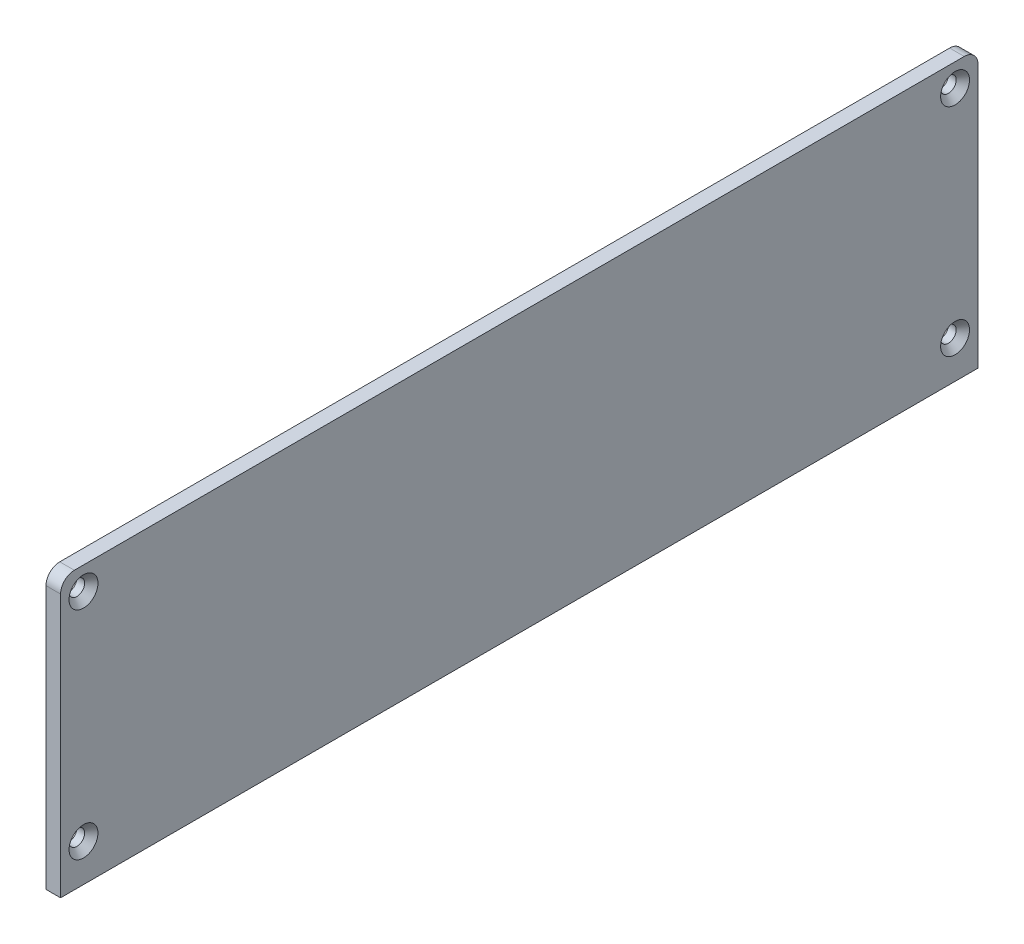
ISO-10303-21;
HEADER;
FILE_DESCRIPTION(('STEP AP214'),'2;1');
FILE_NAME('part.step','',(''),(''),'','','');
FILE_SCHEMA(('AUTOMOTIVE_DESIGN { 1 0 10303 214 1 1 1 1 }'));
ENDSEC;
DATA;
#1=APPLICATION_CONTEXT('core data for automotive mechanical design processes');
#2=APPLICATION_PROTOCOL_DEFINITION('international standard','automotive_design',2000,#1);
#3=PRODUCT_CONTEXT('',#1,'mechanical');
#4=PRODUCT('Part','Part','',(#3));
#5=PRODUCT_RELATED_PRODUCT_CATEGORY('part','',(#4));
#6=PRODUCT_DEFINITION_FORMATION('','',#4);
#7=PRODUCT_DEFINITION_CONTEXT('part definition',#1,'design');
#8=PRODUCT_DEFINITION('design','',#6,#7);
#9=PRODUCT_DEFINITION_SHAPE('','',#8);
#10=(LENGTH_UNIT() NAMED_UNIT(*) SI_UNIT(.MILLI.,.METRE.));
#11=(NAMED_UNIT(*) PLANE_ANGLE_UNIT() SI_UNIT($,.RADIAN.));
#12=(NAMED_UNIT(*) SI_UNIT($,.STERADIAN.) SOLID_ANGLE_UNIT());
#13=UNCERTAINTY_MEASURE_WITH_UNIT(LENGTH_MEASURE(1.E-05),#10,'distance_accuracy_value','');
#14=(GEOMETRIC_REPRESENTATION_CONTEXT(3) GLOBAL_UNCERTAINTY_ASSIGNED_CONTEXT((#13)) GLOBAL_UNIT_ASSIGNED_CONTEXT((#10,
#11,#12)) REPRESENTATION_CONTEXT('',''));
#15=CARTESIAN_POINT('',(0.,0.,0.));
#16=DIRECTION('',(0.,0.,1.));
#17=DIRECTION('',(1.,0.,0.));
#18=AXIS2_PLACEMENT_3D('',#15,#16,#17);
#19=CARTESIAN_POINT('',(3.175,0.,100.));
#20=DIRECTION('',(0.,0.,-1.));
#21=DIRECTION('',(-1.,0.,0.));
#22=AXIS2_PLACEMENT_3D('',#19,#20,#21);
#23=PLANE('',#22);
#24=DIRECTION('',(0.,-1.,0.));
#25=VECTOR('',#24,1.);
#26=CARTESIAN_POINT('',(0.,0.,100.));
#27=LINE('',#26,#25);
#28=CARTESIAN_POINT('',(0.,57.35,100.));
#29=VERTEX_POINT('',#28);
#30=CARTESIAN_POINT('',(0.,0.,100.));
#31=VERTEX_POINT('',#30);
#32=EDGE_CURVE('E116',#29,#31,#27,.T.);
#33=ORIENTED_EDGE('',*,*,#32,.T.);
#34=DIRECTION('',(-1.,0.,0.));
#35=VECTOR('',#34,1.);
#36=CARTESIAN_POINT('',(3.175,0.,100.));
#37=LINE('',#36,#35);
#38=CARTESIAN_POINT('',(3.175,0.,100.));
#39=VERTEX_POINT('',#38);
#40=EDGE_CURVE('E11',#39,#31,#37,.T.);
#41=ORIENTED_EDGE('',*,*,#40,.F.);
#42=DIRECTION('',(0.,-1.,0.));
#43=VECTOR('',#42,1.);
#44=CARTESIAN_POINT('',(3.175,0.,100.));
#45=LINE('',#44,#43);
#46=CARTESIAN_POINT('',(3.175,57.35,100.));
#47=VERTEX_POINT('',#46);
#48=EDGE_CURVE('E127',#47,#39,#45,.T.);
#49=ORIENTED_EDGE('',*,*,#48,.F.);
#50=DIRECTION('',(-1.,0.,0.));
#51=VECTOR('',#50,1.);
#52=CARTESIAN_POINT('',(3.175,57.35,100.));
#53=LINE('',#52,#51);
#54=EDGE_CURVE('E112',#47,#29,#53,.T.);
#55=ORIENTED_EDGE('',*,*,#54,.T.);
#56=EDGE_LOOP('',(#33,#41,#49,#55));
#57=FACE_BOUND('',#56,.T.);
#58=ADVANCED_FACE('F32',(#57),#23,.F.);
#59=CARTESIAN_POINT('',(3.175,0.,100.));
#60=DIRECTION('',(0.,1.,0.));
#61=DIRECTION('',(0.,0.,1.));
#62=AXIS2_PLACEMENT_3D('',#59,#60,#61);
#63=PLANE('',#62);
#64=DIRECTION('',(0.,0.,-1.));
#65=VECTOR('',#64,1.);
#66=CARTESIAN_POINT('',(0.,0.,100.));
#67=LINE('',#66,#65);
#68=CARTESIAN_POINT('',(0.,0.,-100.));
#69=VERTEX_POINT('',#68);
#70=EDGE_CURVE('E119',#31,#69,#67,.T.);
#71=ORIENTED_EDGE('',*,*,#70,.T.);
#72=DIRECTION('',(-1.,0.,0.));
#73=VECTOR('',#72,1.);
#74=CARTESIAN_POINT('',(3.175,0.,-100.));
#75=LINE('',#74,#73);
#76=CARTESIAN_POINT('',(3.175,0.,-100.));
#77=VERTEX_POINT('',#76);
#78=EDGE_CURVE('E40',#77,#69,#75,.T.);
#79=ORIENTED_EDGE('',*,*,#78,.F.);
#80=DIRECTION('',(0.,0.,-1.));
#81=VECTOR('',#80,1.);
#82=CARTESIAN_POINT('',(3.175,0.,100.));
#83=LINE('',#82,#81);
#84=EDGE_CURVE('E85',#39,#77,#83,.T.);
#85=ORIENTED_EDGE('',*,*,#84,.F.);
#86=ORIENTED_EDGE('',*,*,#40,.T.);
#87=EDGE_LOOP('',(#71,#79,#85,#86));
#88=FACE_BOUND('',#87,.T.);
#89=ADVANCED_FACE('F152',(#88),#63,.F.);
#90=CARTESIAN_POINT('',(3.175,0.,-100.));
#91=DIRECTION('',(0.,0.,1.));
#92=DIRECTION('',(1.,0.,0.));
#93=AXIS2_PLACEMENT_3D('',#90,#91,#92);
#94=PLANE('',#93);
#95=DIRECTION('',(0.,1.,0.));
#96=VECTOR('',#95,1.);
#97=CARTESIAN_POINT('',(0.,0.,-100.));
#98=LINE('',#97,#96);
#99=CARTESIAN_POINT('',(0.,57.35,-100.));
#100=VERTEX_POINT('',#99);
#101=EDGE_CURVE('E122',#69,#100,#98,.T.);
#102=ORIENTED_EDGE('',*,*,#101,.T.);
#103=DIRECTION('',(-1.,0.,0.));
#104=VECTOR('',#103,1.);
#105=CARTESIAN_POINT('',(3.175,57.35,-100.));
#106=LINE('',#105,#104);
#107=CARTESIAN_POINT('',(3.175,57.35,-100.));
#108=VERTEX_POINT('',#107);
#109=EDGE_CURVE('E107',#108,#100,#106,.T.);
#110=ORIENTED_EDGE('',*,*,#109,.F.);
#111=DIRECTION('',(0.,1.,0.));
#112=VECTOR('',#111,1.);
#113=CARTESIAN_POINT('',(3.175,0.,-100.));
#114=LINE('',#113,#112);
#115=EDGE_CURVE('E98',#77,#108,#114,.T.);
#116=ORIENTED_EDGE('',*,*,#115,.F.);
#117=ORIENTED_EDGE('',*,*,#78,.T.);
#118=EDGE_LOOP('',(#102,#110,#116,#117));
#119=FACE_BOUND('',#118,.T.);
#120=ADVANCED_FACE('F133',(#119),#94,.F.);
#121=CARTESIAN_POINT('',(3.175,57.35,-97.));
#122=DIRECTION('',(-1.,0.,0.));
#123=DIRECTION('',(0.,0.,1.));
#124=AXIS2_PLACEMENT_3D('',#121,#122,#123);
#125=CYLINDRICAL_SURFACE('',#124,3.);
#126=CARTESIAN_POINT('',(0.,57.35,-97.));
#127=DIRECTION('',(1.,0.,0.));
#128=DIRECTION('',(0.,0.,-1.));
#129=AXIS2_PLACEMENT_3D('',#126,#127,#128);
#130=CIRCLE('',#129,3.);
#131=CARTESIAN_POINT('',(0.,60.35,-97.));
#132=VERTEX_POINT('',#131);
#133=EDGE_CURVE('E106',#100,#132,#130,.T.);
#134=ORIENTED_EDGE('',*,*,#133,.T.);
#135=DIRECTION('',(-1.,0.,0.));
#136=VECTOR('',#135,1.);
#137=CARTESIAN_POINT('',(3.175,60.35,-97.));
#138=LINE('',#137,#136);
#139=CARTESIAN_POINT('',(3.175,60.35,-97.));
#140=VERTEX_POINT('',#139);
#141=EDGE_CURVE('E103',#140,#132,#138,.T.);
#142=ORIENTED_EDGE('',*,*,#141,.F.);
#143=CARTESIAN_POINT('',(3.175,57.35,-97.));
#144=DIRECTION('',(1.,0.,0.));
#145=DIRECTION('',(0.,0.,-1.));
#146=AXIS2_PLACEMENT_3D('',#143,#144,#145);
#147=CIRCLE('',#146,3.);
#148=EDGE_CURVE('E92',#108,#140,#147,.T.);
#149=ORIENTED_EDGE('',*,*,#148,.F.);
#150=ORIENTED_EDGE('',*,*,#109,.T.);
#151=EDGE_LOOP('',(#134,#142,#149,#150));
#152=FACE_BOUND('',#151,.T.);
#153=ADVANCED_FACE('F104',(#152),#125,.T.);
#154=CARTESIAN_POINT('',(3.175,60.35,-97.));
#155=DIRECTION('',(0.,-1.,0.));
#156=DIRECTION('',(0.,0.,-1.));
#157=AXIS2_PLACEMENT_3D('',#154,#155,#156);
#158=PLANE('',#157);
#159=DIRECTION('',(0.,0.,1.));
#160=VECTOR('',#159,1.);
#161=CARTESIAN_POINT('',(0.,60.35,-97.));
#162=LINE('',#161,#160);
#163=CARTESIAN_POINT('',(0.,60.35,97.));
#164=VERTEX_POINT('',#163);
#165=EDGE_CURVE('E71',#132,#164,#162,.T.);
#166=ORIENTED_EDGE('',*,*,#165,.T.);
#167=DIRECTION('',(-1.,0.,0.));
#168=VECTOR('',#167,1.);
#169=CARTESIAN_POINT('',(3.175,60.35,97.));
#170=LINE('',#169,#168);
#171=CARTESIAN_POINT('',(3.175,60.35,97.));
#172=VERTEX_POINT('',#171);
#173=EDGE_CURVE('E108',#172,#164,#170,.T.);
#174=ORIENTED_EDGE('',*,*,#173,.F.);
#175=DIRECTION('',(0.,0.,1.));
#176=VECTOR('',#175,1.);
#177=CARTESIAN_POINT('',(3.175,60.35,-97.));
#178=LINE('',#177,#176);
#179=EDGE_CURVE('E96',#140,#172,#178,.T.);
#180=ORIENTED_EDGE('',*,*,#179,.F.);
#181=ORIENTED_EDGE('',*,*,#141,.T.);
#182=EDGE_LOOP('',(#166,#174,#180,#181));
#183=FACE_BOUND('',#182,.T.);
#184=ADVANCED_FACE('F110',(#183),#158,.F.);
#185=CARTESIAN_POINT('',(3.175,57.35,97.));
#186=DIRECTION('',(-1.,0.,0.));
#187=DIRECTION('',(0.,0.,1.));
#188=AXIS2_PLACEMENT_3D('',#185,#186,#187);
#189=CYLINDRICAL_SURFACE('',#188,3.);
#190=CARTESIAN_POINT('',(0.,57.35,97.));
#191=DIRECTION('',(1.,0.,0.));
#192=DIRECTION('',(0.,0.,-1.));
#193=AXIS2_PLACEMENT_3D('',#190,#191,#192);
#194=CIRCLE('',#193,3.);
#195=EDGE_CURVE('E77',#164,#29,#194,.T.);
#196=ORIENTED_EDGE('',*,*,#195,.T.);
#197=ORIENTED_EDGE('',*,*,#54,.F.);
#198=CARTESIAN_POINT('',(3.175,57.35,97.));
#199=DIRECTION('',(1.,0.,0.));
#200=DIRECTION('',(0.,0.,-1.));
#201=AXIS2_PLACEMENT_3D('',#198,#199,#200);
#202=CIRCLE('',#201,3.);
#203=EDGE_CURVE('E48',#172,#47,#202,.T.);
#204=ORIENTED_EDGE('',*,*,#203,.F.);
#205=ORIENTED_EDGE('',*,*,#173,.T.);
#206=EDGE_LOOP('',(#196,#197,#204,#205));
#207=FACE_BOUND('',#206,.T.);
#208=ADVANCED_FACE('F140',(#207),#189,.T.);
#209=CARTESIAN_POINT('',(3.175,57.35,97.));
#210=DIRECTION('',(1.,0.,0.));
#211=DIRECTION('',(0.,0.,-1.));
#212=AXIS2_PLACEMENT_3D('',#209,#210,#211);
#213=PLANE('',#212);
#214=CARTESIAN_POINT('',(3.175,8.175,-95.));
#215=DIRECTION('',(1.,0.,0.));
#216=DIRECTION('',(0.,0.,-1.));
#217=AXIS2_PLACEMENT_3D('',#214,#215,#216);
#218=CIRCLE('',#217,3.15);
#219=CARTESIAN_POINT('',(3.175,8.175,-98.15));
#220=VERTEX_POINT('',#219);
#221=EDGE_CURVE('E278',#220,#220,#218,.T.);
#222=ORIENTED_EDGE('',*,*,#221,.F.);
#223=EDGE_LOOP('',(#222));
#224=FACE_BOUND('',#223,.T.);
#225=CARTESIAN_POINT('',(3.175,55.35,-95.));
#226=DIRECTION('',(1.,0.,0.));
#227=DIRECTION('',(0.,0.,-1.));
#228=AXIS2_PLACEMENT_3D('',#225,#226,#227);
#229=CIRCLE('',#228,3.15);
#230=CARTESIAN_POINT('',(3.175,55.35,-98.15));
#231=VERTEX_POINT('',#230);
#232=EDGE_CURVE('E285',#231,#231,#229,.T.);
#233=ORIENTED_EDGE('',*,*,#232,.F.);
#234=EDGE_LOOP('',(#233));
#235=FACE_BOUND('',#234,.T.);
#236=CARTESIAN_POINT('',(3.175,8.175,95.));
#237=DIRECTION('',(1.,0.,0.));
#238=DIRECTION('',(0.,0.,-1.));
#239=AXIS2_PLACEMENT_3D('',#236,#237,#238);
#240=CIRCLE('',#239,3.15);
#241=CARTESIAN_POINT('',(3.175,8.175,91.85));
#242=VERTEX_POINT('',#241);
#243=EDGE_CURVE('E294',#242,#242,#240,.T.);
#244=ORIENTED_EDGE('',*,*,#243,.F.);
#245=EDGE_LOOP('',(#244));
#246=FACE_BOUND('',#245,.T.);
#247=CARTESIAN_POINT('',(3.175,55.35,95.));
#248=DIRECTION('',(1.,0.,0.));
#249=DIRECTION('',(0.,0.,-1.));
#250=AXIS2_PLACEMENT_3D('',#247,#248,#249);
#251=CIRCLE('',#250,3.15);
#252=CARTESIAN_POINT('',(3.175,55.35,91.85));
#253=VERTEX_POINT('',#252);
#254=EDGE_CURVE('E303',#253,#253,#251,.T.);
#255=ORIENTED_EDGE('',*,*,#254,.F.);
#256=EDGE_LOOP('',(#255));
#257=FACE_BOUND('',#256,.T.);
#258=ORIENTED_EDGE('',*,*,#48,.T.);
#259=ORIENTED_EDGE('',*,*,#84,.T.);
#260=ORIENTED_EDGE('',*,*,#115,.T.);
#261=ORIENTED_EDGE('',*,*,#148,.T.);
#262=ORIENTED_EDGE('',*,*,#179,.T.);
#263=ORIENTED_EDGE('',*,*,#203,.T.);
#264=EDGE_LOOP('',(#258,#259,#260,#261,#262,#263));
#265=FACE_BOUND('',#264,.T.);
#266=ADVANCED_FACE('F94',(#224,#235,#246,#257,#265),#213,.T.);
#267=CARTESIAN_POINT('',(0.,57.35,97.));
#268=DIRECTION('',(1.,0.,0.));
#269=DIRECTION('',(0.,0.,-1.));
#270=AXIS2_PLACEMENT_3D('',#267,#268,#269);
#271=PLANE('',#270);
#272=CARTESIAN_POINT('',(0.,8.175,-95.));
#273=DIRECTION('',(1.,0.,0.));
#274=DIRECTION('',(0.,0.,-1.));
#275=AXIS2_PLACEMENT_3D('',#272,#273,#274);
#276=CIRCLE('',#275,1.7);
#277=CARTESIAN_POINT('',(0.,8.175,-96.7));
#278=VERTEX_POINT('',#277);
#279=EDGE_CURVE('E280',#278,#278,#276,.T.);
#280=ORIENTED_EDGE('',*,*,#279,.T.);
#281=EDGE_LOOP('',(#280));
#282=FACE_BOUND('',#281,.T.);
#283=CARTESIAN_POINT('',(0.,55.35,-95.));
#284=DIRECTION('',(1.,0.,0.));
#285=DIRECTION('',(0.,0.,-1.));
#286=AXIS2_PLACEMENT_3D('',#283,#284,#285);
#287=CIRCLE('',#286,1.7);
#288=CARTESIAN_POINT('',(0.,55.35,-96.7));
#289=VERTEX_POINT('',#288);
#290=EDGE_CURVE('E291',#289,#289,#287,.T.);
#291=ORIENTED_EDGE('',*,*,#290,.T.);
#292=EDGE_LOOP('',(#291));
#293=FACE_BOUND('',#292,.T.);
#294=CARTESIAN_POINT('',(0.,8.175,95.));
#295=DIRECTION('',(1.,0.,0.));
#296=DIRECTION('',(0.,0.,-1.));
#297=AXIS2_PLACEMENT_3D('',#294,#295,#296);
#298=CIRCLE('',#297,1.7);
#299=CARTESIAN_POINT('',(0.,8.175,93.3));
#300=VERTEX_POINT('',#299);
#301=EDGE_CURVE('E300',#300,#300,#298,.T.);
#302=ORIENTED_EDGE('',*,*,#301,.T.);
#303=EDGE_LOOP('',(#302));
#304=FACE_BOUND('',#303,.T.);
#305=CARTESIAN_POINT('',(0.,55.35,95.));
#306=DIRECTION('',(1.,0.,0.));
#307=DIRECTION('',(0.,0.,-1.));
#308=AXIS2_PLACEMENT_3D('',#305,#306,#307);
#309=CIRCLE('',#308,1.7);
#310=CARTESIAN_POINT('',(0.,55.35,93.3));
#311=VERTEX_POINT('',#310);
#312=EDGE_CURVE('E120',#311,#311,#309,.T.);
#313=ORIENTED_EDGE('',*,*,#312,.T.);
#314=EDGE_LOOP('',(#313));
#315=FACE_BOUND('',#314,.T.);
#316=ORIENTED_EDGE('',*,*,#32,.F.);
#317=ORIENTED_EDGE('',*,*,#195,.F.);
#318=ORIENTED_EDGE('',*,*,#165,.F.);
#319=ORIENTED_EDGE('',*,*,#133,.F.);
#320=ORIENTED_EDGE('',*,*,#101,.F.);
#321=ORIENTED_EDGE('',*,*,#70,.F.);
#322=EDGE_LOOP('',(#316,#317,#318,#319,#320,#321));
#323=FACE_BOUND('',#322,.T.);
#324=ADVANCED_FACE('F136',(#282,#293,#304,#315,#323),#271,.F.);
#325=CARTESIAN_POINT('',(3.175,55.35,95.));
#326=DIRECTION('',(1.,0.,0.));
#327=DIRECTION('',(0.,0.,-1.));
#328=AXIS2_PLACEMENT_3D('',#325,#326,#327);
#329=CYLINDRICAL_SURFACE('',#328,1.7);
#330=ORIENTED_EDGE('',*,*,#312,.F.);
#331=EDGE_LOOP('',(#330));
#332=FACE_BOUND('',#331,.T.);
#333=CARTESIAN_POINT('',(1.725,55.35,95.));
#334=DIRECTION('',(1.,0.,0.));
#335=DIRECTION('',(0.,0.,-1.));
#336=AXIS2_PLACEMENT_3D('',#333,#334,#335);
#337=CIRCLE('',#336,1.7);
#338=CARTESIAN_POINT('',(1.725,55.35,93.3));
#339=VERTEX_POINT('',#338);
#340=EDGE_CURVE('E306',#339,#339,#337,.T.);
#341=ORIENTED_EDGE('',*,*,#340,.T.);
#342=EDGE_LOOP('',(#341));
#343=FACE_BOUND('',#342,.T.);
#344=ADVANCED_FACE('F180',(#332,#343),#329,.F.);
#345=CARTESIAN_POINT('',(3.175,55.35,95.));
#346=DIRECTION('',(1.,0.,0.));
#347=DIRECTION('',(0.,0.,-1.));
#348=AXIS2_PLACEMENT_3D('',#345,#346,#347);
#349=CONICAL_SURFACE('',#348,3.15,0.785398163397447);
#350=ORIENTED_EDGE('',*,*,#340,.F.);
#351=EDGE_LOOP('',(#350));
#352=FACE_BOUND('',#351,.T.);
#353=ORIENTED_EDGE('',*,*,#254,.T.);
#354=EDGE_LOOP('',(#353));
#355=FACE_BOUND('',#354,.T.);
#356=ADVANCED_FACE('F185',(#352,#355),#349,.F.);
#357=CARTESIAN_POINT('',(3.175,8.175,95.));
#358=DIRECTION('',(1.,0.,0.));
#359=DIRECTION('',(0.,0.,-1.));
#360=AXIS2_PLACEMENT_3D('',#357,#358,#359);
#361=CYLINDRICAL_SURFACE('',#360,1.7);
#362=ORIENTED_EDGE('',*,*,#301,.F.);
#363=EDGE_LOOP('',(#362));
#364=FACE_BOUND('',#363,.T.);
#365=CARTESIAN_POINT('',(1.725,8.175,95.));
#366=DIRECTION('',(1.,0.,0.));
#367=DIRECTION('',(0.,0.,-1.));
#368=AXIS2_PLACEMENT_3D('',#365,#366,#367);
#369=CIRCLE('',#368,1.7);
#370=CARTESIAN_POINT('',(1.725,8.175,93.3));
#371=VERTEX_POINT('',#370);
#372=EDGE_CURVE('E297',#371,#371,#369,.T.);
#373=ORIENTED_EDGE('',*,*,#372,.T.);
#374=EDGE_LOOP('',(#373));
#375=FACE_BOUND('',#374,.T.);
#376=ADVANCED_FACE('F197',(#364,#375),#361,.F.);
#377=CARTESIAN_POINT('',(3.175,8.175,95.));
#378=DIRECTION('',(1.,0.,0.));
#379=DIRECTION('',(0.,0.,-1.));
#380=AXIS2_PLACEMENT_3D('',#377,#378,#379);
#381=CONICAL_SURFACE('',#380,3.15,0.785398163397448);
#382=ORIENTED_EDGE('',*,*,#372,.F.);
#383=EDGE_LOOP('',(#382));
#384=FACE_BOUND('',#383,.T.);
#385=ORIENTED_EDGE('',*,*,#243,.T.);
#386=EDGE_LOOP('',(#385));
#387=FACE_BOUND('',#386,.T.);
#388=ADVANCED_FACE('F207',(#384,#387),#381,.F.);
#389=CARTESIAN_POINT('',(3.175,55.35,-95.));
#390=DIRECTION('',(1.,0.,0.));
#391=DIRECTION('',(0.,0.,-1.));
#392=AXIS2_PLACEMENT_3D('',#389,#390,#391);
#393=CYLINDRICAL_SURFACE('',#392,1.7);
#394=ORIENTED_EDGE('',*,*,#290,.F.);
#395=EDGE_LOOP('',(#394));
#396=FACE_BOUND('',#395,.T.);
#397=CARTESIAN_POINT('',(1.725,55.35,-95.));
#398=DIRECTION('',(1.,0.,0.));
#399=DIRECTION('',(0.,0.,-1.));
#400=AXIS2_PLACEMENT_3D('',#397,#398,#399);
#401=CIRCLE('',#400,1.7);
#402=CARTESIAN_POINT('',(1.725,55.35,-96.7));
#403=VERTEX_POINT('',#402);
#404=EDGE_CURVE('E288',#403,#403,#401,.T.);
#405=ORIENTED_EDGE('',*,*,#404,.T.);
#406=EDGE_LOOP('',(#405));
#407=FACE_BOUND('',#406,.T.);
#408=ADVANCED_FACE('F217',(#396,#407),#393,.F.);
#409=CARTESIAN_POINT('',(3.175,55.35,-95.));
#410=DIRECTION('',(1.,0.,0.));
#411=DIRECTION('',(0.,0.,-1.));
#412=AXIS2_PLACEMENT_3D('',#409,#410,#411);
#413=CONICAL_SURFACE('',#412,3.15,0.785398163397447);
#414=ORIENTED_EDGE('',*,*,#404,.F.);
#415=EDGE_LOOP('',(#414));
#416=FACE_BOUND('',#415,.T.);
#417=ORIENTED_EDGE('',*,*,#232,.T.);
#418=EDGE_LOOP('',(#417));
#419=FACE_BOUND('',#418,.T.);
#420=ADVANCED_FACE('F238',(#416,#419),#413,.F.);
#421=CARTESIAN_POINT('',(3.175,8.175,-95.));
#422=DIRECTION('',(1.,0.,0.));
#423=DIRECTION('',(0.,0.,-1.));
#424=AXIS2_PLACEMENT_3D('',#421,#422,#423);
#425=CYLINDRICAL_SURFACE('',#424,1.7);
#426=ORIENTED_EDGE('',*,*,#279,.F.);
#427=EDGE_LOOP('',(#426));
#428=FACE_BOUND('',#427,.T.);
#429=CARTESIAN_POINT('',(1.725,8.175,-95.));
#430=DIRECTION('',(1.,0.,0.));
#431=DIRECTION('',(0.,0.,-1.));
#432=AXIS2_PLACEMENT_3D('',#429,#430,#431);
#433=CIRCLE('',#432,1.7);
#434=CARTESIAN_POINT('',(1.725,8.175,-96.7));
#435=VERTEX_POINT('',#434);
#436=EDGE_CURVE('E275',#435,#435,#433,.T.);
#437=ORIENTED_EDGE('',*,*,#436,.T.);
#438=EDGE_LOOP('',(#437));
#439=FACE_BOUND('',#438,.T.);
#440=ADVANCED_FACE('F248',(#428,#439),#425,.F.);
#441=CARTESIAN_POINT('',(3.175,8.175,-95.));
#442=DIRECTION('',(1.,0.,0.));
#443=DIRECTION('',(0.,0.,-1.));
#444=AXIS2_PLACEMENT_3D('',#441,#442,#443);
#445=CONICAL_SURFACE('',#444,3.15,0.785398163397448);
#446=ORIENTED_EDGE('',*,*,#436,.F.);
#447=EDGE_LOOP('',(#446));
#448=FACE_BOUND('',#447,.T.);
#449=ORIENTED_EDGE('',*,*,#221,.T.);
#450=EDGE_LOOP('',(#449));
#451=FACE_BOUND('',#450,.T.);
#452=ADVANCED_FACE('F258',(#448,#451),#445,.F.);
#453=CLOSED_SHELL('',(#58,#89,#120,#153,#184,#208,#266,#324,#344,#356,#376,#388,#408,#420,#440,#452));
#454=MANIFOLD_SOLID_BREP('B2',#453);
#455=ADVANCED_BREP_SHAPE_REPRESENTATION('',(#18,#454),#14);
#456=SHAPE_DEFINITION_REPRESENTATION(#9,#455);
ENDSEC;
END-ISO-10303-21;
